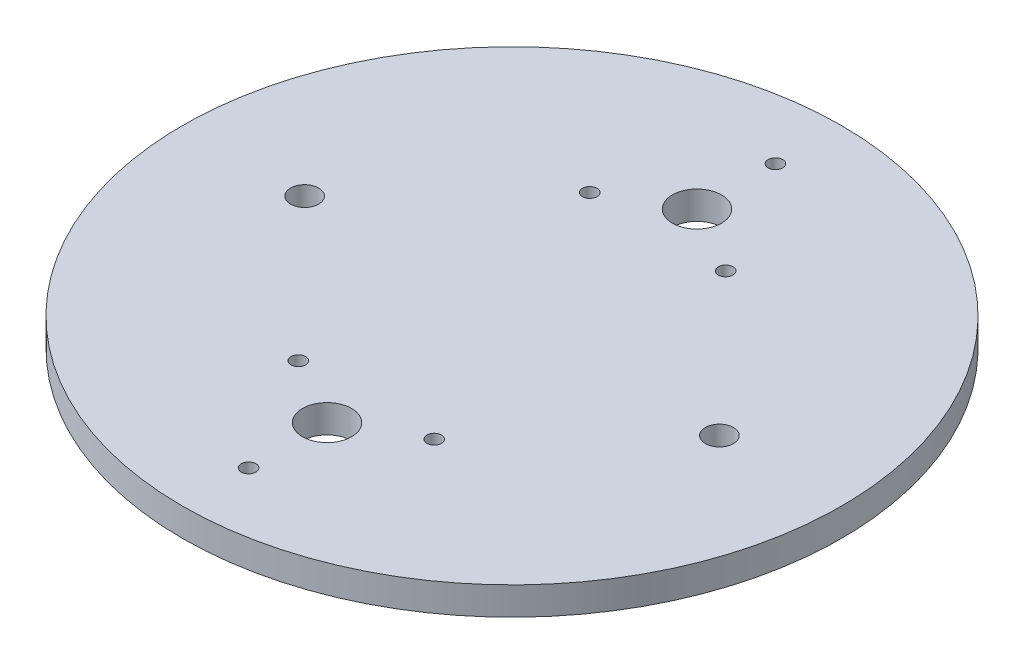
ISO-10303-21;
HEADER;
FILE_DESCRIPTION(('STEP AP214'),'2;1');
FILE_NAME('part.step','',(''),(''),'','','');
FILE_SCHEMA(('AUTOMOTIVE_DESIGN { 1 0 10303 214 1 1 1 1 }'));
ENDSEC;
DATA;
#1=APPLICATION_CONTEXT('core data for automotive mechanical design processes');
#2=APPLICATION_PROTOCOL_DEFINITION('international standard','automotive_design',2000,#1);
#3=PRODUCT_CONTEXT('',#1,'mechanical');
#4=PRODUCT('Part','Part','',(#3));
#5=PRODUCT_RELATED_PRODUCT_CATEGORY('part','',(#4));
#6=PRODUCT_DEFINITION_FORMATION('','',#4);
#7=PRODUCT_DEFINITION_CONTEXT('part definition',#1,'design');
#8=PRODUCT_DEFINITION('design','',#6,#7);
#9=PRODUCT_DEFINITION_SHAPE('','',#8);
#10=(LENGTH_UNIT() NAMED_UNIT(*) SI_UNIT(.MILLI.,.METRE.));
#11=(NAMED_UNIT(*) PLANE_ANGLE_UNIT() SI_UNIT($,.RADIAN.));
#12=(NAMED_UNIT(*) SI_UNIT($,.STERADIAN.) SOLID_ANGLE_UNIT());
#13=UNCERTAINTY_MEASURE_WITH_UNIT(LENGTH_MEASURE(1.E-05),#10,'distance_accuracy_value','');
#14=(GEOMETRIC_REPRESENTATION_CONTEXT(3) GLOBAL_UNCERTAINTY_ASSIGNED_CONTEXT((#13)) GLOBAL_UNIT_ASSIGNED_CONTEXT((#10,
#11,#12)) REPRESENTATION_CONTEXT('',''));
#15=CARTESIAN_POINT('',(0.,0.,0.));
#16=DIRECTION('',(0.,0.,1.));
#17=DIRECTION('',(1.,0.,0.));
#18=AXIS2_PLACEMENT_3D('',#15,#16,#17);
#19=CARTESIAN_POINT('',(0.,6.35,0.));
#20=DIRECTION('',(0.,-1.,0.));
#21=DIRECTION('',(0.,0.,-1.));
#22=AXIS2_PLACEMENT_3D('',#19,#20,#21);
#23=CYLINDRICAL_SURFACE('',#22,74.676);
#24=CARTESIAN_POINT('',(0.,6.35,0.));
#25=DIRECTION('',(0.,1.,0.));
#26=DIRECTION('',(0.,0.,1.));
#27=AXIS2_PLACEMENT_3D('',#24,#25,#26);
#28=CIRCLE('',#27,74.676);
#29=CARTESIAN_POINT('',(0.,6.35,74.676));
#30=VERTEX_POINT('',#29);
#31=EDGE_CURVE('E10',#30,#30,#28,.T.);
#32=ORIENTED_EDGE('',*,*,#31,.F.);
#33=EDGE_LOOP('',(#32));
#34=FACE_BOUND('',#33,.T.);
#35=CARTESIAN_POINT('',(0.,0.,0.));
#36=DIRECTION('',(0.,1.,0.));
#37=DIRECTION('',(0.,0.,1.));
#38=AXIS2_PLACEMENT_3D('',#35,#36,#37);
#39=CIRCLE('',#38,74.676);
#40=CARTESIAN_POINT('',(0.,0.,74.676));
#41=VERTEX_POINT('',#40);
#42=EDGE_CURVE('E38',#41,#41,#39,.T.);
#43=ORIENTED_EDGE('',*,*,#42,.T.);
#44=EDGE_LOOP('',(#43));
#45=FACE_BOUND('',#44,.T.);
#46=ADVANCED_FACE('F35',(#34,#45),#23,.T.);
#47=CARTESIAN_POINT('',(0.,6.35,0.));
#48=DIRECTION('',(0.,1.,0.));
#49=DIRECTION('',(0.,0.,1.));
#50=AXIS2_PLACEMENT_3D('',#47,#48,#49);
#51=PLANE('',#50);
#52=CARTESIAN_POINT('',(46.99,6.35,0.));
#53=DIRECTION('',(0.,1.,0.));
#54=DIRECTION('',(0.,0.,-1.));
#55=AXIS2_PLACEMENT_3D('',#52,#53,#54);
#56=CIRCLE('',#55,3.175);
#57=CARTESIAN_POINT('',(46.99,6.35,-3.17500000000001));
#58=VERTEX_POINT('',#57);
#59=EDGE_CURVE('E103',#58,#58,#56,.T.);
#60=ORIENTED_EDGE('',*,*,#59,.F.);
#61=EDGE_LOOP('',(#60));
#62=FACE_BOUND('',#61,.T.);
#63=CARTESIAN_POINT('',(-46.99,6.35,0.));
#64=DIRECTION('',(0.,1.,0.));
#65=DIRECTION('',(0.,0.,1.));
#66=AXIS2_PLACEMENT_3D('',#63,#64,#65);
#67=CIRCLE('',#66,3.175);
#68=CARTESIAN_POINT('',(-46.99,6.35,3.175));
#69=VERTEX_POINT('',#68);
#70=EDGE_CURVE('E97',#69,#69,#67,.T.);
#71=ORIENTED_EDGE('',*,*,#70,.F.);
#72=EDGE_LOOP('',(#71));
#73=FACE_BOUND('',#72,.T.);
#74=CARTESIAN_POINT('',(0.,6.35,41.91));
#75=DIRECTION('',(0.,1.,0.));
#76=DIRECTION('',(0.,0.,-1.));
#77=AXIS2_PLACEMENT_3D('',#74,#75,#76);
#78=CIRCLE('',#77,5.5626);
#79=CARTESIAN_POINT('',(0.,6.35,36.3474));
#80=VERTEX_POINT('',#79);
#81=EDGE_CURVE('E75',#80,#80,#78,.T.);
#82=ORIENTED_EDGE('',*,*,#81,.F.);
#83=EDGE_LOOP('',(#82));
#84=FACE_BOUND('',#83,.T.);
#85=CARTESIAN_POINT('',(15.397931679288,6.35,33.0200000000004));
#86=DIRECTION('',(0.,1.,0.));
#87=DIRECTION('',(0.,0.,-1.));
#88=AXIS2_PLACEMENT_3D('',#85,#86,#87);
#89=CIRCLE('',#88,1.65099999999999);
#90=CARTESIAN_POINT('',(15.397931679288,6.35,31.3690000000004));
#91=VERTEX_POINT('',#90);
#92=EDGE_CURVE('E74',#91,#91,#89,.T.);
#93=ORIENTED_EDGE('',*,*,#92,.F.);
#94=EDGE_LOOP('',(#93));
#95=FACE_BOUND('',#94,.T.);
#96=CARTESIAN_POINT('',(-15.3979316792866,6.35,-33.0199999999997));
#97=DIRECTION('',(0.,1.,0.));
#98=DIRECTION('',(0.,0.,1.));
#99=AXIS2_PLACEMENT_3D('',#96,#97,#98);
#100=CIRCLE('',#99,1.651);
#101=CARTESIAN_POINT('',(-15.3979316792866,6.35,-31.3689999999997));
#102=VERTEX_POINT('',#101);
#103=EDGE_CURVE('E82',#102,#102,#100,.T.);
#104=ORIENTED_EDGE('',*,*,#103,.F.);
#105=EDGE_LOOP('',(#104));
#106=FACE_BOUND('',#105,.T.);
#107=CARTESIAN_POINT('',(-15.3979316792866,6.35,33.0199999999997));
#108=DIRECTION('',(0.,1.,0.));
#109=DIRECTION('',(0.,0.,-1.));
#110=AXIS2_PLACEMENT_3D('',#107,#108,#109);
#111=CIRCLE('',#110,1.651);
#112=CARTESIAN_POINT('',(-15.3979316792866,6.35,31.3689999999997));
#113=VERTEX_POINT('',#112);
#114=EDGE_CURVE('E88',#113,#113,#111,.T.);
#115=ORIENTED_EDGE('',*,*,#114,.F.);
#116=EDGE_LOOP('',(#115));
#117=FACE_BOUND('',#116,.T.);
#118=CARTESIAN_POINT('',(0.,6.35,-59.69));
#119=DIRECTION('',(0.,1.,0.));
#120=DIRECTION('',(0.,0.,1.));
#121=AXIS2_PLACEMENT_3D('',#118,#119,#120);
#122=CIRCLE('',#121,1.651);
#123=CARTESIAN_POINT('',(0.,6.35,-58.039));
#124=VERTEX_POINT('',#123);
#125=EDGE_CURVE('E57',#124,#124,#122,.T.);
#126=ORIENTED_EDGE('',*,*,#125,.F.);
#127=EDGE_LOOP('',(#126));
#128=FACE_BOUND('',#127,.T.);
#129=CARTESIAN_POINT('',(0.,6.35,-41.91));
#130=DIRECTION('',(0.,1.,0.));
#131=DIRECTION('',(0.,0.,1.));
#132=AXIS2_PLACEMENT_3D('',#129,#130,#131);
#133=CIRCLE('',#132,5.5626);
#134=CARTESIAN_POINT('',(0.,6.35,-36.3474));
#135=VERTEX_POINT('',#134);
#136=EDGE_CURVE('E56',#135,#135,#133,.T.);
#137=ORIENTED_EDGE('',*,*,#136,.F.);
#138=EDGE_LOOP('',(#137));
#139=FACE_BOUND('',#138,.T.);
#140=CARTESIAN_POINT('',(15.397931679288,6.35,-33.0200000000004));
#141=DIRECTION('',(0.,1.,0.));
#142=DIRECTION('',(0.,0.,1.));
#143=AXIS2_PLACEMENT_3D('',#140,#141,#142);
#144=CIRCLE('',#143,1.65099999999999);
#145=CARTESIAN_POINT('',(15.397931679288,6.35,-31.3690000000004));
#146=VERTEX_POINT('',#145);
#147=EDGE_CURVE('E64',#146,#146,#144,.T.);
#148=ORIENTED_EDGE('',*,*,#147,.F.);
#149=EDGE_LOOP('',(#148));
#150=FACE_BOUND('',#149,.T.);
#151=CARTESIAN_POINT('',(0.,6.35,59.69));
#152=DIRECTION('',(0.,1.,0.));
#153=DIRECTION('',(0.,0.,-1.));
#154=AXIS2_PLACEMENT_3D('',#151,#152,#153);
#155=CIRCLE('',#154,1.651);
#156=CARTESIAN_POINT('',(0.,6.35,58.039));
#157=VERTEX_POINT('',#156);
#158=EDGE_CURVE('E49',#157,#157,#155,.T.);
#159=ORIENTED_EDGE('',*,*,#158,.F.);
#160=EDGE_LOOP('',(#159));
#161=FACE_BOUND('',#160,.T.);
#162=ORIENTED_EDGE('',*,*,#31,.T.);
#163=EDGE_LOOP('',(#162));
#164=FACE_BOUND('',#163,.T.);
#165=ADVANCED_FACE('F109',(#62,#73,#84,#95,#106,#117,#128,#139,#150,#161,#164),#51,.T.);
#166=CARTESIAN_POINT('',(0.,0.,0.));
#167=DIRECTION('',(0.,1.,0.));
#168=DIRECTION('',(0.,0.,1.));
#169=AXIS2_PLACEMENT_3D('',#166,#167,#168);
#170=PLANE('',#169);
#171=CARTESIAN_POINT('',(46.99,0.,0.));
#172=DIRECTION('',(0.,1.,0.));
#173=DIRECTION('',(0.,0.,1.));
#174=AXIS2_PLACEMENT_3D('',#171,#172,#173);
#175=CIRCLE('',#174,3.175);
#176=CARTESIAN_POINT('',(46.99,0.,3.17499999999999));
#177=VERTEX_POINT('',#176);
#178=EDGE_CURVE('E100',#177,#177,#175,.F.);
#179=ORIENTED_EDGE('',*,*,#178,.F.);
#180=EDGE_LOOP('',(#179));
#181=FACE_BOUND('',#180,.T.);
#182=CARTESIAN_POINT('',(-46.99,0.,0.));
#183=DIRECTION('',(0.,1.,0.));
#184=DIRECTION('',(0.,0.,1.));
#185=AXIS2_PLACEMENT_3D('',#182,#183,#184);
#186=CIRCLE('',#185,3.175);
#187=CARTESIAN_POINT('',(-46.99,0.,3.175));
#188=VERTEX_POINT('',#187);
#189=EDGE_CURVE('E78',#188,#188,#186,.F.);
#190=ORIENTED_EDGE('',*,*,#189,.F.);
#191=EDGE_LOOP('',(#190));
#192=FACE_BOUND('',#191,.T.);
#193=CARTESIAN_POINT('',(0.,0.,41.91));
#194=DIRECTION('',(0.,1.,0.));
#195=DIRECTION('',(0.,0.,1.));
#196=AXIS2_PLACEMENT_3D('',#193,#194,#195);
#197=CIRCLE('',#196,5.5626);
#198=CARTESIAN_POINT('',(0.,0.,47.4726));
#199=VERTEX_POINT('',#198);
#200=EDGE_CURVE('E71',#199,#199,#197,.F.);
#201=ORIENTED_EDGE('',*,*,#200,.F.);
#202=EDGE_LOOP('',(#201));
#203=FACE_BOUND('',#202,.T.);
#204=CARTESIAN_POINT('',(15.397931679288,0.,33.0200000000004));
#205=DIRECTION('',(0.,1.,0.));
#206=DIRECTION('',(0.,0.,1.));
#207=AXIS2_PLACEMENT_3D('',#204,#205,#206);
#208=CIRCLE('',#207,1.65099999999999);
#209=CARTESIAN_POINT('',(15.397931679288,0.,34.6710000000003));
#210=VERTEX_POINT('',#209);
#211=EDGE_CURVE('E79',#210,#210,#208,.F.);
#212=ORIENTED_EDGE('',*,*,#211,.F.);
#213=EDGE_LOOP('',(#212));
#214=FACE_BOUND('',#213,.T.);
#215=CARTESIAN_POINT('',(-15.3979316792866,0.,-33.0199999999997));
#216=DIRECTION('',(0.,1.,0.));
#217=DIRECTION('',(0.,0.,1.));
#218=AXIS2_PLACEMENT_3D('',#215,#216,#217);
#219=CIRCLE('',#218,1.651);
#220=CARTESIAN_POINT('',(-15.3979316792866,0.,-31.3689999999997));
#221=VERTEX_POINT('',#220);
#222=EDGE_CURVE('E85',#221,#221,#219,.F.);
#223=ORIENTED_EDGE('',*,*,#222,.F.);
#224=EDGE_LOOP('',(#223));
#225=FACE_BOUND('',#224,.T.);
#226=CARTESIAN_POINT('',(-15.3979316792866,0.,33.0199999999997));
#227=DIRECTION('',(0.,1.,0.));
#228=DIRECTION('',(0.,0.,1.));
#229=AXIS2_PLACEMENT_3D('',#226,#227,#228);
#230=CIRCLE('',#229,1.651);
#231=CARTESIAN_POINT('',(-15.3979316792866,0.,34.6709999999997));
#232=VERTEX_POINT('',#231);
#233=EDGE_CURVE('E60',#232,#232,#230,.F.);
#234=ORIENTED_EDGE('',*,*,#233,.F.);
#235=EDGE_LOOP('',(#234));
#236=FACE_BOUND('',#235,.T.);
#237=CARTESIAN_POINT('',(0.,0.,-59.69));
#238=DIRECTION('',(0.,1.,0.));
#239=DIRECTION('',(0.,0.,1.));
#240=AXIS2_PLACEMENT_3D('',#237,#238,#239);
#241=CIRCLE('',#240,1.651);
#242=CARTESIAN_POINT('',(0.,0.,-58.039));
#243=VERTEX_POINT('',#242);
#244=EDGE_CURVE('E53',#243,#243,#241,.F.);
#245=ORIENTED_EDGE('',*,*,#244,.F.);
#246=EDGE_LOOP('',(#245));
#247=FACE_BOUND('',#246,.T.);
#248=CARTESIAN_POINT('',(0.,0.,-41.91));
#249=DIRECTION('',(0.,1.,0.));
#250=DIRECTION('',(0.,0.,1.));
#251=AXIS2_PLACEMENT_3D('',#248,#249,#250);
#252=CIRCLE('',#251,5.5626);
#253=CARTESIAN_POINT('',(0.,0.,-36.3474));
#254=VERTEX_POINT('',#253);
#255=EDGE_CURVE('E61',#254,#254,#252,.F.);
#256=ORIENTED_EDGE('',*,*,#255,.F.);
#257=EDGE_LOOP('',(#256));
#258=FACE_BOUND('',#257,.T.);
#259=CARTESIAN_POINT('',(15.397931679288,0.,-33.0200000000004));
#260=DIRECTION('',(0.,1.,0.));
#261=DIRECTION('',(0.,0.,1.));
#262=AXIS2_PLACEMENT_3D('',#259,#260,#261);
#263=CIRCLE('',#262,1.65099999999999);
#264=CARTESIAN_POINT('',(15.397931679288,0.,-31.3690000000004));
#265=VERTEX_POINT('',#264);
#266=EDGE_CURVE('E52',#265,#265,#263,.F.);
#267=ORIENTED_EDGE('',*,*,#266,.F.);
#268=EDGE_LOOP('',(#267));
#269=FACE_BOUND('',#268,.T.);
#270=CARTESIAN_POINT('',(0.,0.,59.69));
#271=DIRECTION('',(0.,1.,0.));
#272=DIRECTION('',(0.,0.,1.));
#273=AXIS2_PLACEMENT_3D('',#270,#271,#272);
#274=CIRCLE('',#273,1.651);
#275=CARTESIAN_POINT('',(0.,0.,61.341));
#276=VERTEX_POINT('',#275);
#277=EDGE_CURVE('E45',#276,#276,#274,.F.);
#278=ORIENTED_EDGE('',*,*,#277,.F.);
#279=EDGE_LOOP('',(#278));
#280=FACE_BOUND('',#279,.T.);
#281=ORIENTED_EDGE('',*,*,#42,.F.);
#282=EDGE_LOOP('',(#281));
#283=FACE_BOUND('',#282,.T.);
#284=ADVANCED_FACE('F112',(#181,#192,#203,#214,#225,#236,#247,#258,#269,#280,#283),#170,.F.);
#285=CARTESIAN_POINT('',(0.,-15.7334087241132,59.69));
#286=DIRECTION('',(0.,1.,0.));
#287=DIRECTION('',(0.,0.,1.));
#288=AXIS2_PLACEMENT_3D('',#285,#286,#287);
#289=CYLINDRICAL_SURFACE('',#288,1.651);
#290=ORIENTED_EDGE('',*,*,#277,.T.);
#291=EDGE_LOOP('',(#290));
#292=FACE_BOUND('',#291,.T.);
#293=ORIENTED_EDGE('',*,*,#158,.T.);
#294=EDGE_LOOP('',(#293));
#295=FACE_BOUND('',#294,.T.);
#296=ADVANCED_FACE('F132',(#292,#295),#289,.F.);
#297=CARTESIAN_POINT('',(15.397931679288,-15.7334087241132,-33.0200000000004));
#298=DIRECTION('',(0.,1.,0.));
#299=DIRECTION('',(0.,0.,1.));
#300=AXIS2_PLACEMENT_3D('',#297,#298,#299);
#301=CYLINDRICAL_SURFACE('',#300,1.65099999999999);
#302=ORIENTED_EDGE('',*,*,#266,.T.);
#303=EDGE_LOOP('',(#302));
#304=FACE_BOUND('',#303,.T.);
#305=ORIENTED_EDGE('',*,*,#147,.T.);
#306=EDGE_LOOP('',(#305));
#307=FACE_BOUND('',#306,.T.);
#308=ADVANCED_FACE('F134',(#304,#307),#301,.F.);
#309=CARTESIAN_POINT('',(0.,-15.7334087241132,-41.91));
#310=DIRECTION('',(0.,1.,0.));
#311=DIRECTION('',(0.,0.,1.));
#312=AXIS2_PLACEMENT_3D('',#309,#310,#311);
#313=CYLINDRICAL_SURFACE('',#312,5.5626);
#314=ORIENTED_EDGE('',*,*,#255,.T.);
#315=EDGE_LOOP('',(#314));
#316=FACE_BOUND('',#315,.T.);
#317=ORIENTED_EDGE('',*,*,#136,.T.);
#318=EDGE_LOOP('',(#317));
#319=FACE_BOUND('',#318,.T.);
#320=ADVANCED_FACE('F141',(#316,#319),#313,.F.);
#321=CARTESIAN_POINT('',(0.,-15.7334087241132,-59.69));
#322=DIRECTION('',(0.,1.,0.));
#323=DIRECTION('',(0.,0.,1.));
#324=AXIS2_PLACEMENT_3D('',#321,#322,#323);
#325=CYLINDRICAL_SURFACE('',#324,1.651);
#326=ORIENTED_EDGE('',*,*,#244,.T.);
#327=EDGE_LOOP('',(#326));
#328=FACE_BOUND('',#327,.T.);
#329=ORIENTED_EDGE('',*,*,#125,.T.);
#330=EDGE_LOOP('',(#329));
#331=FACE_BOUND('',#330,.T.);
#332=ADVANCED_FACE('F196',(#328,#331),#325,.F.);
#333=CARTESIAN_POINT('',(-15.3979316792866,-15.7334087241132,33.0199999999997));
#334=DIRECTION('',(0.,1.,0.));
#335=DIRECTION('',(0.,0.,1.));
#336=AXIS2_PLACEMENT_3D('',#333,#334,#335);
#337=CYLINDRICAL_SURFACE('',#336,1.651);
#338=ORIENTED_EDGE('',*,*,#233,.T.);
#339=EDGE_LOOP('',(#338));
#340=FACE_BOUND('',#339,.T.);
#341=ORIENTED_EDGE('',*,*,#114,.T.);
#342=EDGE_LOOP('',(#341));
#343=FACE_BOUND('',#342,.T.);
#344=ADVANCED_FACE('F192',(#340,#343),#337,.F.);
#345=CARTESIAN_POINT('',(-15.3979316792866,-15.7334087241132,-33.0199999999997));
#346=DIRECTION('',(0.,1.,0.));
#347=DIRECTION('',(0.,0.,1.));
#348=AXIS2_PLACEMENT_3D('',#345,#346,#347);
#349=CYLINDRICAL_SURFACE('',#348,1.651);
#350=ORIENTED_EDGE('',*,*,#222,.T.);
#351=EDGE_LOOP('',(#350));
#352=FACE_BOUND('',#351,.T.);
#353=ORIENTED_EDGE('',*,*,#103,.T.);
#354=EDGE_LOOP('',(#353));
#355=FACE_BOUND('',#354,.T.);
#356=ADVANCED_FACE('F195',(#352,#355),#349,.F.);
#357=CARTESIAN_POINT('',(15.397931679288,-15.7334087241132,33.0200000000004));
#358=DIRECTION('',(0.,1.,0.));
#359=DIRECTION('',(0.,0.,1.));
#360=AXIS2_PLACEMENT_3D('',#357,#358,#359);
#361=CYLINDRICAL_SURFACE('',#360,1.65099999999999);
#362=ORIENTED_EDGE('',*,*,#211,.T.);
#363=EDGE_LOOP('',(#362));
#364=FACE_BOUND('',#363,.T.);
#365=ORIENTED_EDGE('',*,*,#92,.T.);
#366=EDGE_LOOP('',(#365));
#367=FACE_BOUND('',#366,.T.);
#368=ADVANCED_FACE('F200',(#364,#367),#361,.F.);
#369=CARTESIAN_POINT('',(0.,-15.7334087241132,41.91));
#370=DIRECTION('',(0.,1.,0.));
#371=DIRECTION('',(0.,0.,1.));
#372=AXIS2_PLACEMENT_3D('',#369,#370,#371);
#373=CYLINDRICAL_SURFACE('',#372,5.5626);
#374=ORIENTED_EDGE('',*,*,#200,.T.);
#375=EDGE_LOOP('',(#374));
#376=FACE_BOUND('',#375,.T.);
#377=ORIENTED_EDGE('',*,*,#81,.T.);
#378=EDGE_LOOP('',(#377));
#379=FACE_BOUND('',#378,.T.);
#380=ADVANCED_FACE('F175',(#376,#379),#373,.F.);
#381=CARTESIAN_POINT('',(-46.99,-8.98025612106915,0.));
#382=DIRECTION('',(0.,1.,0.));
#383=DIRECTION('',(0.,0.,1.));
#384=AXIS2_PLACEMENT_3D('',#381,#382,#383);
#385=CYLINDRICAL_SURFACE('',#384,3.175);
#386=ORIENTED_EDGE('',*,*,#189,.T.);
#387=EDGE_LOOP('',(#386));
#388=FACE_BOUND('',#387,.T.);
#389=ORIENTED_EDGE('',*,*,#70,.T.);
#390=EDGE_LOOP('',(#389));
#391=FACE_BOUND('',#390,.T.);
#392=ADVANCED_FACE('F170',(#388,#391),#385,.F.);
#393=CARTESIAN_POINT('',(46.99,-8.98025612106915,0.));
#394=DIRECTION('',(0.,1.,0.));
#395=DIRECTION('',(0.,0.,1.));
#396=AXIS2_PLACEMENT_3D('',#393,#394,#395);
#397=CYLINDRICAL_SURFACE('',#396,3.175);
#398=ORIENTED_EDGE('',*,*,#178,.T.);
#399=EDGE_LOOP('',(#398));
#400=FACE_BOUND('',#399,.T.);
#401=ORIENTED_EDGE('',*,*,#59,.T.);
#402=EDGE_LOOP('',(#401));
#403=FACE_BOUND('',#402,.T.);
#404=ADVANCED_FACE('F107',(#400,#403),#397,.F.);
#405=CLOSED_SHELL('',(#46,#165,#284,#296,#308,#320,#332,#344,#356,#368,#380,#392,#404));
#406=MANIFOLD_SOLID_BREP('B2',#405);
#407=ADVANCED_BREP_SHAPE_REPRESENTATION('',(#18,#406),#14);
#408=SHAPE_DEFINITION_REPRESENTATION(#9,#407);
ENDSEC;
END-ISO-10303-21;
